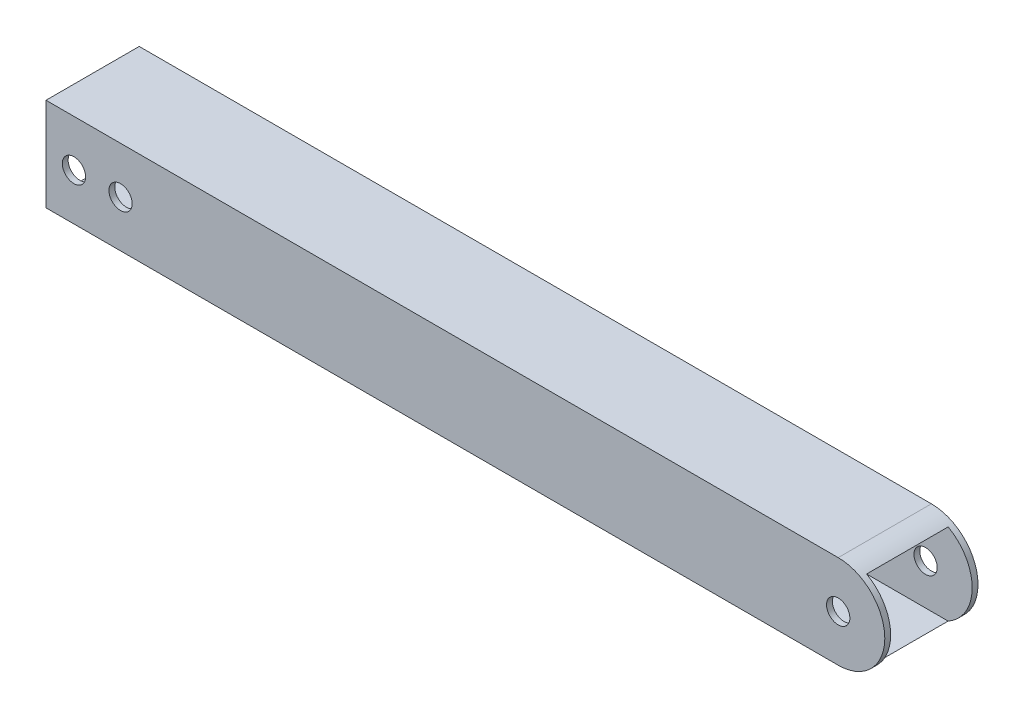
ISO-10303-21;
HEADER;
FILE_DESCRIPTION(('STEP AP214'),'2;1');
FILE_NAME('part.step','',(''),(''),'','','');
FILE_SCHEMA(('AUTOMOTIVE_DESIGN { 1 0 10303 214 1 1 1 1 }'));
ENDSEC;
DATA;
#1=APPLICATION_CONTEXT('core data for automotive mechanical design processes');
#2=APPLICATION_PROTOCOL_DEFINITION('international standard','automotive_design',2000,#1);
#3=PRODUCT_CONTEXT('',#1,'mechanical');
#4=PRODUCT('Part','Part','',(#3));
#5=PRODUCT_RELATED_PRODUCT_CATEGORY('part','',(#4));
#6=PRODUCT_DEFINITION_FORMATION('','',#4);
#7=PRODUCT_DEFINITION_CONTEXT('part definition',#1,'design');
#8=PRODUCT_DEFINITION('design','',#6,#7);
#9=PRODUCT_DEFINITION_SHAPE('','',#8);
#10=(LENGTH_UNIT() NAMED_UNIT(*) SI_UNIT(.MILLI.,.METRE.));
#11=(NAMED_UNIT(*) PLANE_ANGLE_UNIT() SI_UNIT($,.RADIAN.));
#12=(NAMED_UNIT(*) SI_UNIT($,.STERADIAN.) SOLID_ANGLE_UNIT());
#13=UNCERTAINTY_MEASURE_WITH_UNIT(LENGTH_MEASURE(1.E-05),#10,'distance_accuracy_value','');
#14=(GEOMETRIC_REPRESENTATION_CONTEXT(3) GLOBAL_UNCERTAINTY_ASSIGNED_CONTEXT((#13)) GLOBAL_UNIT_ASSIGNED_CONTEXT((#10,
#11,#12)) REPRESENTATION_CONTEXT('',''));
#15=CARTESIAN_POINT('',(0.,0.,0.));
#16=DIRECTION('',(0.,0.,1.));
#17=DIRECTION('',(1.,0.,0.));
#18=AXIS2_PLACEMENT_3D('',#15,#16,#17);
#19=CARTESIAN_POINT('',(228.6,12.7,-12.7));
#20=DIRECTION('',(0.,0.,1.));
#21=DIRECTION('',(0.,-1.,0.));
#22=AXIS2_PLACEMENT_3D('',#19,#20,#21);
#23=PLANE('',#22);
#24=CARTESIAN_POINT('',(215.9,0.,-12.7));
#25=DIRECTION('',(0.,0.,1.));
#26=DIRECTION('',(1.,0.,0.));
#27=AXIS2_PLACEMENT_3D('',#24,#25,#26);
#28=CIRCLE('',#27,3.175);
#29=CARTESIAN_POINT('',(219.075,0.,-12.7));
#30=VERTEX_POINT('',#29);
#31=EDGE_CURVE('E137',#30,#30,#28,.T.);
#32=ORIENTED_EDGE('',*,*,#31,.T.);
#33=EDGE_LOOP('',(#32));
#34=FACE_BOUND('',#33,.T.);
#35=CARTESIAN_POINT('',(7.62,0.,-12.7));
#36=DIRECTION('',(0.,0.,1.));
#37=DIRECTION('',(1.,0.,0.));
#38=AXIS2_PLACEMENT_3D('',#35,#36,#37);
#39=CIRCLE('',#38,3.175);
#40=CARTESIAN_POINT('',(10.795,0.,-12.7));
#41=VERTEX_POINT('',#40);
#42=EDGE_CURVE('E192',#41,#41,#39,.T.);
#43=ORIENTED_EDGE('',*,*,#42,.T.);
#44=EDGE_LOOP('',(#43));
#45=FACE_BOUND('',#44,.T.);
#46=CARTESIAN_POINT('',(20.32,0.,-12.7));
#47=DIRECTION('',(0.,0.,1.));
#48=DIRECTION('',(1.,0.,0.));
#49=AXIS2_PLACEMENT_3D('',#46,#47,#48);
#50=CIRCLE('',#49,3.175);
#51=CARTESIAN_POINT('',(23.495,0.,-12.7));
#52=VERTEX_POINT('',#51);
#53=EDGE_CURVE('E198',#52,#52,#50,.T.);
#54=ORIENTED_EDGE('',*,*,#53,.T.);
#55=EDGE_LOOP('',(#54));
#56=FACE_BOUND('',#55,.T.);
#57=CARTESIAN_POINT('',(215.9,0.,-12.7));
#58=DIRECTION('',(0.,0.,1.));
#59=DIRECTION('',(1.,0.,0.));
#60=AXIS2_PLACEMENT_3D('',#57,#58,#59);
#61=CIRCLE('',#60,12.7);
#62=CARTESIAN_POINT('',(215.9,12.7,-12.7));
#63=VERTEX_POINT('',#62);
#64=CARTESIAN_POINT('',(215.9,-12.7,-12.7));
#65=VERTEX_POINT('',#64);
#66=EDGE_CURVE('E100',#63,#65,#61,.F.);
#67=ORIENTED_EDGE('',*,*,#66,.T.);
#68=DIRECTION('',(-1.,0.,0.));
#69=VECTOR('',#68,1.);
#70=CARTESIAN_POINT('',(228.6,-12.7,-12.7));
#71=LINE('',#70,#69);
#72=CARTESIAN_POINT('',(0.,-12.7,-12.7));
#73=VERTEX_POINT('',#72);
#74=EDGE_CURVE('E104',#65,#73,#71,.T.);
#75=ORIENTED_EDGE('',*,*,#74,.T.);
#76=DIRECTION('',(0.,1.,0.));
#77=VECTOR('',#76,1.);
#78=CARTESIAN_POINT('',(0.,12.7,-12.7));
#79=LINE('',#78,#77);
#80=CARTESIAN_POINT('',(0.,12.7,-12.7));
#81=VERTEX_POINT('',#80);
#82=EDGE_CURVE('E167',#73,#81,#79,.T.);
#83=ORIENTED_EDGE('',*,*,#82,.T.);
#84=DIRECTION('',(-1.,0.,0.));
#85=VECTOR('',#84,1.);
#86=CARTESIAN_POINT('',(228.6,12.7,-12.7));
#87=LINE('',#86,#85);
#88=EDGE_CURVE('E106',#63,#81,#87,.T.);
#89=ORIENTED_EDGE('',*,*,#88,.F.);
#90=EDGE_LOOP('',(#67,#75,#83,#89));
#91=FACE_BOUND('',#90,.T.);
#92=ADVANCED_FACE('F37',(#34,#45,#56,#91),#23,.F.);
#93=CARTESIAN_POINT('',(228.6,12.7,12.7));
#94=DIRECTION('',(0.,0.,-1.));
#95=DIRECTION('',(0.,1.,0.));
#96=AXIS2_PLACEMENT_3D('',#93,#94,#95);
#97=PLANE('',#96);
#98=CARTESIAN_POINT('',(215.9,0.,12.7));
#99=DIRECTION('',(0.,0.,1.));
#100=DIRECTION('',(1.,0.,0.));
#101=AXIS2_PLACEMENT_3D('',#98,#99,#100);
#102=CIRCLE('',#101,3.175);
#103=CARTESIAN_POINT('',(219.075,0.,12.7));
#104=VERTEX_POINT('',#103);
#105=EDGE_CURVE('E189',#104,#104,#102,.T.);
#106=ORIENTED_EDGE('',*,*,#105,.F.);
#107=EDGE_LOOP('',(#106));
#108=FACE_BOUND('',#107,.T.);
#109=CARTESIAN_POINT('',(7.62,0.,12.7));
#110=DIRECTION('',(0.,0.,1.));
#111=DIRECTION('',(1.,0.,0.));
#112=AXIS2_PLACEMENT_3D('',#109,#110,#111);
#113=CIRCLE('',#112,3.175);
#114=CARTESIAN_POINT('',(10.795,0.,12.7));
#115=VERTEX_POINT('',#114);
#116=EDGE_CURVE('E195',#115,#115,#113,.T.);
#117=ORIENTED_EDGE('',*,*,#116,.F.);
#118=EDGE_LOOP('',(#117));
#119=FACE_BOUND('',#118,.T.);
#120=CARTESIAN_POINT('',(20.32,0.,12.7));
#121=DIRECTION('',(0.,0.,1.));
#122=DIRECTION('',(1.,0.,0.));
#123=AXIS2_PLACEMENT_3D('',#120,#121,#122);
#124=CIRCLE('',#123,3.175);
#125=CARTESIAN_POINT('',(23.495,0.,12.7));
#126=VERTEX_POINT('',#125);
#127=EDGE_CURVE('E186',#126,#126,#124,.T.);
#128=ORIENTED_EDGE('',*,*,#127,.F.);
#129=EDGE_LOOP('',(#128));
#130=FACE_BOUND('',#129,.T.);
#131=DIRECTION('',(-1.,0.,0.));
#132=VECTOR('',#131,1.);
#133=CARTESIAN_POINT('',(228.6,-12.7,12.7));
#134=LINE('',#133,#132);
#135=CARTESIAN_POINT('',(215.9,-12.7,12.7));
#136=VERTEX_POINT('',#135);
#137=CARTESIAN_POINT('',(0.,-12.7,12.7));
#138=VERTEX_POINT('',#137);
#139=EDGE_CURVE('E123',#136,#138,#134,.T.);
#140=ORIENTED_EDGE('',*,*,#139,.F.);
#141=CARTESIAN_POINT('',(215.9,0.,12.7));
#142=DIRECTION('',(0.,0.,1.));
#143=DIRECTION('',(1.,0.,0.));
#144=AXIS2_PLACEMENT_3D('',#141,#142,#143);
#145=CIRCLE('',#144,12.7);
#146=CARTESIAN_POINT('',(215.9,12.7,12.7));
#147=VERTEX_POINT('',#146);
#148=EDGE_CURVE('E110',#147,#136,#145,.F.);
#149=ORIENTED_EDGE('',*,*,#148,.F.);
#150=DIRECTION('',(-1.,0.,0.));
#151=VECTOR('',#150,1.);
#152=CARTESIAN_POINT('',(228.6,12.7,12.7));
#153=LINE('',#152,#151);
#154=CARTESIAN_POINT('',(0.,12.7,12.7));
#155=VERTEX_POINT('',#154);
#156=EDGE_CURVE('E125',#147,#155,#153,.T.);
#157=ORIENTED_EDGE('',*,*,#156,.T.);
#158=DIRECTION('',(0.,-1.,0.));
#159=VECTOR('',#158,1.);
#160=CARTESIAN_POINT('',(0.,12.7,12.7));
#161=LINE('',#160,#159);
#162=EDGE_CURVE('E127',#155,#138,#161,.T.);
#163=ORIENTED_EDGE('',*,*,#162,.T.);
#164=EDGE_LOOP('',(#140,#149,#157,#163));
#165=FACE_BOUND('',#164,.T.);
#166=ADVANCED_FACE('F174',(#108,#119,#130,#165),#97,.F.);
#167=CARTESIAN_POINT('',(228.6,11.1125,11.1125));
#168=DIRECTION('',(0.,0.,-1.));
#169=DIRECTION('',(0.,1.,0.));
#170=AXIS2_PLACEMENT_3D('',#167,#168,#169);
#171=PLANE('',#170);
#172=CARTESIAN_POINT('',(215.9,0.,11.1125));
#173=DIRECTION('',(0.,0.,-1.));
#174=DIRECTION('',(0.,1.,0.));
#175=AXIS2_PLACEMENT_3D('',#172,#173,#174);
#176=CIRCLE('',#175,3.175);
#177=CARTESIAN_POINT('',(215.9,3.175,11.1125));
#178=VERTEX_POINT('',#177);
#179=EDGE_CURVE('E144',#178,#178,#176,.T.);
#180=ORIENTED_EDGE('',*,*,#179,.F.);
#181=EDGE_LOOP('',(#180));
#182=FACE_BOUND('',#181,.T.);
#183=CARTESIAN_POINT('',(7.62,0.,11.1125));
#184=DIRECTION('',(0.,0.,-1.));
#185=DIRECTION('',(0.,1.,0.));
#186=AXIS2_PLACEMENT_3D('',#183,#184,#185);
#187=CIRCLE('',#186,3.175);
#188=CARTESIAN_POINT('',(7.62,3.175,11.1125));
#189=VERTEX_POINT('',#188);
#190=EDGE_CURVE('E141',#189,#189,#187,.T.);
#191=ORIENTED_EDGE('',*,*,#190,.F.);
#192=EDGE_LOOP('',(#191));
#193=FACE_BOUND('',#192,.T.);
#194=CARTESIAN_POINT('',(20.32,0.,11.1125));
#195=DIRECTION('',(0.,0.,-1.));
#196=DIRECTION('',(0.,1.,0.));
#197=AXIS2_PLACEMENT_3D('',#194,#195,#196);
#198=CIRCLE('',#197,3.175);
#199=CARTESIAN_POINT('',(20.32,3.175,11.1125));
#200=VERTEX_POINT('',#199);
#201=EDGE_CURVE('E136',#200,#200,#198,.T.);
#202=ORIENTED_EDGE('',*,*,#201,.F.);
#203=EDGE_LOOP('',(#202));
#204=FACE_BOUND('',#203,.T.);
#205=CARTESIAN_POINT('',(215.9,0.,11.1125));
#206=DIRECTION('',(0.,0.,-1.));
#207=DIRECTION('',(0.,1.,0.));
#208=AXIS2_PLACEMENT_3D('',#205,#206,#207);
#209=CIRCLE('',#208,12.7);
#210=CARTESIAN_POINT('',(222.048361062104,-11.1125,11.1125));
#211=VERTEX_POINT('',#210);
#212=CARTESIAN_POINT('',(222.048361062104,11.1125,11.1125));
#213=VERTEX_POINT('',#212);
#214=EDGE_CURVE('E50',#211,#213,#209,.F.);
#215=ORIENTED_EDGE('',*,*,#214,.F.);
#216=DIRECTION('',(-1.,0.,0.));
#217=VECTOR('',#216,1.);
#218=CARTESIAN_POINT('',(228.6,-11.1125,11.1125));
#219=LINE('',#218,#217);
#220=CARTESIAN_POINT('',(0.,-11.1125,11.1125));
#221=VERTEX_POINT('',#220);
#222=EDGE_CURVE('E161',#211,#221,#219,.T.);
#223=ORIENTED_EDGE('',*,*,#222,.T.);
#224=DIRECTION('',(0.,-1.,0.));
#225=VECTOR('',#224,1.);
#226=CARTESIAN_POINT('',(0.,11.1125,11.1125));
#227=LINE('',#226,#225);
#228=CARTESIAN_POINT('',(0.,11.1125,11.1125));
#229=VERTEX_POINT('',#228);
#230=EDGE_CURVE('E209',#229,#221,#227,.T.);
#231=ORIENTED_EDGE('',*,*,#230,.F.);
#232=DIRECTION('',(-1.,0.,0.));
#233=VECTOR('',#232,1.);
#234=CARTESIAN_POINT('',(228.6,11.1125,11.1125));
#235=LINE('',#234,#233);
#236=EDGE_CURVE('E57',#213,#229,#235,.T.);
#237=ORIENTED_EDGE('',*,*,#236,.F.);
#238=EDGE_LOOP('',(#215,#223,#231,#237));
#239=FACE_BOUND('',#238,.T.);
#240=ADVANCED_FACE('F221',(#182,#193,#204,#239),#171,.T.);
#241=CARTESIAN_POINT('',(228.6,11.1125,-11.1125));
#242=DIRECTION('',(0.,0.,1.));
#243=DIRECTION('',(0.,-1.,0.));
#244=AXIS2_PLACEMENT_3D('',#241,#242,#243);
#245=PLANE('',#244);
#246=CARTESIAN_POINT('',(215.9,0.,-11.1125));
#247=DIRECTION('',(0.,0.,1.));
#248=DIRECTION('',(0.,-1.,0.));
#249=AXIS2_PLACEMENT_3D('',#246,#247,#248);
#250=CIRCLE('',#249,3.175);
#251=CARTESIAN_POINT('',(215.9,-3.175,-11.1125));
#252=VERTEX_POINT('',#251);
#253=EDGE_CURVE('E142',#252,#252,#250,.T.);
#254=ORIENTED_EDGE('',*,*,#253,.F.);
#255=EDGE_LOOP('',(#254));
#256=FACE_BOUND('',#255,.T.);
#257=CARTESIAN_POINT('',(7.62,0.,-11.1125));
#258=DIRECTION('',(0.,0.,1.));
#259=DIRECTION('',(0.,-1.,0.));
#260=AXIS2_PLACEMENT_3D('',#257,#258,#259);
#261=CIRCLE('',#260,3.175);
#262=CARTESIAN_POINT('',(7.62,-3.175,-11.1125));
#263=VERTEX_POINT('',#262);
#264=EDGE_CURVE('E138',#263,#263,#261,.T.);
#265=ORIENTED_EDGE('',*,*,#264,.F.);
#266=EDGE_LOOP('',(#265));
#267=FACE_BOUND('',#266,.T.);
#268=CARTESIAN_POINT('',(20.32,0.,-11.1125));
#269=DIRECTION('',(0.,0.,1.));
#270=DIRECTION('',(0.,-1.,0.));
#271=AXIS2_PLACEMENT_3D('',#268,#269,#270);
#272=CIRCLE('',#271,3.175);
#273=CARTESIAN_POINT('',(20.32,-3.175,-11.1125));
#274=VERTEX_POINT('',#273);
#275=EDGE_CURVE('E133',#274,#274,#272,.T.);
#276=ORIENTED_EDGE('',*,*,#275,.F.);
#277=EDGE_LOOP('',(#276));
#278=FACE_BOUND('',#277,.T.);
#279=DIRECTION('',(-1.,0.,0.));
#280=VECTOR('',#279,1.);
#281=CARTESIAN_POINT('',(228.6,-11.1125,-11.1125));
#282=LINE('',#281,#280);
#283=CARTESIAN_POINT('',(222.048361062104,-11.1125,-11.1125));
#284=VERTEX_POINT('',#283);
#285=CARTESIAN_POINT('',(0.,-11.1125,-11.1125));
#286=VERTEX_POINT('',#285);
#287=EDGE_CURVE('E154',#284,#286,#282,.T.);
#288=ORIENTED_EDGE('',*,*,#287,.F.);
#289=CARTESIAN_POINT('',(215.9,0.,-11.1125));
#290=DIRECTION('',(0.,0.,1.));
#291=DIRECTION('',(0.,-1.,0.));
#292=AXIS2_PLACEMENT_3D('',#289,#290,#291);
#293=CIRCLE('',#292,12.7);
#294=CARTESIAN_POINT('',(222.048361062104,11.1125,-11.1125));
#295=VERTEX_POINT('',#294);
#296=EDGE_CURVE('E146',#295,#284,#293,.F.);
#297=ORIENTED_EDGE('',*,*,#296,.F.);
#298=DIRECTION('',(-1.,0.,0.));
#299=VECTOR('',#298,1.);
#300=CARTESIAN_POINT('',(228.6,11.1125,-11.1125));
#301=LINE('',#300,#299);
#302=CARTESIAN_POINT('',(0.,11.1125,-11.1125));
#303=VERTEX_POINT('',#302);
#304=EDGE_CURVE('E153',#295,#303,#301,.T.);
#305=ORIENTED_EDGE('',*,*,#304,.T.);
#306=DIRECTION('',(0.,1.,0.));
#307=VECTOR('',#306,1.);
#308=CARTESIAN_POINT('',(0.,11.1125,-11.1125));
#309=LINE('',#308,#307);
#310=EDGE_CURVE('E215',#286,#303,#309,.T.);
#311=ORIENTED_EDGE('',*,*,#310,.F.);
#312=EDGE_LOOP('',(#288,#297,#305,#311));
#313=FACE_BOUND('',#312,.T.);
#314=ADVANCED_FACE('F151',(#256,#267,#278,#313),#245,.T.);
#315=CARTESIAN_POINT('',(228.6,-12.7,12.7));
#316=DIRECTION('',(0.,1.,0.));
#317=DIRECTION('',(0.,0.,1.));
#318=AXIS2_PLACEMENT_3D('',#315,#316,#317);
#319=PLANE('',#318);
#320=DIRECTION('',(0.,0.,1.));
#321=VECTOR('',#320,1.);
#322=CARTESIAN_POINT('',(215.9,-12.7,-12.7));
#323=LINE('',#322,#321);
#324=EDGE_CURVE('E113',#65,#136,#323,.T.);
#325=ORIENTED_EDGE('',*,*,#324,.T.);
#326=ORIENTED_EDGE('',*,*,#139,.T.);
#327=DIRECTION('',(0.,0.,-1.));
#328=VECTOR('',#327,1.);
#329=CARTESIAN_POINT('',(0.,-12.7,12.7));
#330=LINE('',#329,#328);
#331=EDGE_CURVE('E121',#138,#73,#330,.T.);
#332=ORIENTED_EDGE('',*,*,#331,.T.);
#333=ORIENTED_EDGE('',*,*,#74,.F.);
#334=EDGE_LOOP('',(#325,#326,#332,#333));
#335=FACE_BOUND('',#334,.T.);
#336=ADVANCED_FACE('F119',(#335),#319,.F.);
#337=CARTESIAN_POINT('',(0.,0.,0.));
#338=DIRECTION('',(1.,0.,0.));
#339=DIRECTION('',(0.,0.,-1.));
#340=AXIS2_PLACEMENT_3D('',#337,#338,#339);
#341=PLANE('',#340);
#342=ORIENTED_EDGE('',*,*,#82,.F.);
#343=ORIENTED_EDGE('',*,*,#331,.F.);
#344=ORIENTED_EDGE('',*,*,#162,.F.);
#345=DIRECTION('',(0.,0.,1.));
#346=VECTOR('',#345,1.);
#347=CARTESIAN_POINT('',(0.,12.7,12.7));
#348=LINE('',#347,#346);
#349=EDGE_CURVE('E169',#81,#155,#348,.T.);
#350=ORIENTED_EDGE('',*,*,#349,.F.);
#351=EDGE_LOOP('',(#342,#343,#344,#350));
#352=FACE_BOUND('',#351,.T.);
#353=ORIENTED_EDGE('',*,*,#230,.T.);
#354=DIRECTION('',(0.,0.,-1.));
#355=VECTOR('',#354,1.);
#356=CARTESIAN_POINT('',(0.,-11.1125,11.1125));
#357=LINE('',#356,#355);
#358=EDGE_CURVE('E212',#221,#286,#357,.T.);
#359=ORIENTED_EDGE('',*,*,#358,.T.);
#360=ORIENTED_EDGE('',*,*,#310,.T.);
#361=DIRECTION('',(0.,0.,1.));
#362=VECTOR('',#361,1.);
#363=CARTESIAN_POINT('',(0.,11.1125,11.1125));
#364=LINE('',#363,#362);
#365=EDGE_CURVE('E158',#303,#229,#364,.T.);
#366=ORIENTED_EDGE('',*,*,#365,.T.);
#367=EDGE_LOOP('',(#353,#359,#360,#366));
#368=FACE_BOUND('',#367,.T.);
#369=ADVANCED_FACE('F178',(#352,#368),#341,.F.);
#370=CARTESIAN_POINT('',(228.6,12.7,12.7));
#371=DIRECTION('',(0.,-1.,0.));
#372=DIRECTION('',(0.,0.,-1.));
#373=AXIS2_PLACEMENT_3D('',#370,#371,#372);
#374=PLANE('',#373);
#375=ORIENTED_EDGE('',*,*,#156,.F.);
#376=DIRECTION('',(0.,0.,1.));
#377=VECTOR('',#376,1.);
#378=CARTESIAN_POINT('',(215.9,12.7,-12.7));
#379=LINE('',#378,#377);
#380=EDGE_CURVE('E109',#63,#147,#379,.T.);
#381=ORIENTED_EDGE('',*,*,#380,.F.);
#382=ORIENTED_EDGE('',*,*,#88,.T.);
#383=ORIENTED_EDGE('',*,*,#349,.T.);
#384=EDGE_LOOP('',(#375,#381,#382,#383));
#385=FACE_BOUND('',#384,.T.);
#386=ADVANCED_FACE('F181',(#385),#374,.F.);
#387=CARTESIAN_POINT('',(228.6,-11.1125,11.1125));
#388=DIRECTION('',(0.,1.,0.));
#389=DIRECTION('',(0.,0.,1.));
#390=AXIS2_PLACEMENT_3D('',#387,#388,#389);
#391=PLANE('',#390);
#392=DIRECTION('',(0.,0.,1.));
#393=VECTOR('',#392,1.);
#394=CARTESIAN_POINT('',(222.048361062104,-11.1125,-12.7));
#395=LINE('',#394,#393);
#396=EDGE_CURVE('E11',#284,#211,#395,.T.);
#397=ORIENTED_EDGE('',*,*,#396,.F.);
#398=ORIENTED_EDGE('',*,*,#287,.T.);
#399=ORIENTED_EDGE('',*,*,#358,.F.);
#400=ORIENTED_EDGE('',*,*,#222,.F.);
#401=EDGE_LOOP('',(#397,#398,#399,#400));
#402=FACE_BOUND('',#401,.T.);
#403=ADVANCED_FACE('F219',(#402),#391,.T.);
#404=CARTESIAN_POINT('',(228.6,11.1125,11.1125));
#405=DIRECTION('',(0.,-1.,0.));
#406=DIRECTION('',(0.,0.,-1.));
#407=AXIS2_PLACEMENT_3D('',#404,#405,#406);
#408=PLANE('',#407);
#409=DIRECTION('',(0.,0.,1.));
#410=VECTOR('',#409,1.);
#411=CARTESIAN_POINT('',(222.048361062104,11.1125,-12.7));
#412=LINE('',#411,#410);
#413=EDGE_CURVE('E44',#213,#295,#412,.F.);
#414=ORIENTED_EDGE('',*,*,#413,.F.);
#415=ORIENTED_EDGE('',*,*,#236,.T.);
#416=ORIENTED_EDGE('',*,*,#365,.F.);
#417=ORIENTED_EDGE('',*,*,#304,.F.);
#418=EDGE_LOOP('',(#414,#415,#416,#417));
#419=FACE_BOUND('',#418,.T.);
#420=ADVANCED_FACE('F156',(#419),#408,.T.);
#421=CARTESIAN_POINT('',(20.32,0.,-12.7));
#422=DIRECTION('',(0.,0.,1.));
#423=DIRECTION('',(1.,0.,0.));
#424=AXIS2_PLACEMENT_3D('',#421,#422,#423);
#425=CYLINDRICAL_SURFACE('',#424,3.175);
#426=ORIENTED_EDGE('',*,*,#275,.T.);
#427=EDGE_LOOP('',(#426));
#428=FACE_BOUND('',#427,.T.);
#429=ORIENTED_EDGE('',*,*,#53,.F.);
#430=EDGE_LOOP('',(#429));
#431=FACE_BOUND('',#430,.T.);
#432=ADVANCED_FACE('F247',(#428,#431),#425,.F.);
#433=CARTESIAN_POINT('',(7.62,0.,-12.7));
#434=DIRECTION('',(0.,0.,1.));
#435=DIRECTION('',(1.,0.,0.));
#436=AXIS2_PLACEMENT_3D('',#433,#434,#435);
#437=CYLINDRICAL_SURFACE('',#436,3.175);
#438=ORIENTED_EDGE('',*,*,#264,.T.);
#439=EDGE_LOOP('',(#438));
#440=FACE_BOUND('',#439,.T.);
#441=ORIENTED_EDGE('',*,*,#42,.F.);
#442=EDGE_LOOP('',(#441));
#443=FACE_BOUND('',#442,.T.);
#444=ADVANCED_FACE('F249',(#440,#443),#437,.F.);
#445=CARTESIAN_POINT('',(215.9,0.,-12.7));
#446=DIRECTION('',(0.,0.,1.));
#447=DIRECTION('',(1.,0.,0.));
#448=AXIS2_PLACEMENT_3D('',#445,#446,#447);
#449=CYLINDRICAL_SURFACE('',#448,3.175);
#450=ORIENTED_EDGE('',*,*,#253,.T.);
#451=EDGE_LOOP('',(#450));
#452=FACE_BOUND('',#451,.T.);
#453=ORIENTED_EDGE('',*,*,#31,.F.);
#454=EDGE_LOOP('',(#453));
#455=FACE_BOUND('',#454,.T.);
#456=ADVANCED_FACE('F257',(#452,#455),#449,.F.);
#457=ORIENTED_EDGE('',*,*,#201,.T.);
#458=EDGE_LOOP('',(#457));
#459=FACE_BOUND('',#458,.T.);
#460=ORIENTED_EDGE('',*,*,#127,.T.);
#461=EDGE_LOOP('',(#460));
#462=FACE_BOUND('',#461,.T.);
#463=ADVANCED_FACE('F252',(#459,#462),#425,.F.);
#464=ORIENTED_EDGE('',*,*,#190,.T.);
#465=EDGE_LOOP('',(#464));
#466=FACE_BOUND('',#465,.T.);
#467=ORIENTED_EDGE('',*,*,#116,.T.);
#468=EDGE_LOOP('',(#467));
#469=FACE_BOUND('',#468,.T.);
#470=ADVANCED_FACE('F260',(#466,#469),#437,.F.);
#471=ORIENTED_EDGE('',*,*,#179,.T.);
#472=EDGE_LOOP('',(#471));
#473=FACE_BOUND('',#472,.T.);
#474=ORIENTED_EDGE('',*,*,#105,.T.);
#475=EDGE_LOOP('',(#474));
#476=FACE_BOUND('',#475,.T.);
#477=ADVANCED_FACE('F268',(#473,#476),#449,.F.);
#478=CARTESIAN_POINT('',(215.9,0.,-12.7));
#479=DIRECTION('',(0.,0.,1.));
#480=DIRECTION('',(1.,0.,0.));
#481=AXIS2_PLACEMENT_3D('',#478,#479,#480);
#482=CYLINDRICAL_SURFACE('',#481,12.7);
#483=ORIENTED_EDGE('',*,*,#296,.T.);
#484=ORIENTED_EDGE('',*,*,#396,.T.);
#485=ORIENTED_EDGE('',*,*,#214,.T.);
#486=ORIENTED_EDGE('',*,*,#413,.T.);
#487=EDGE_LOOP('',(#483,#484,#485,#486));
#488=FACE_BOUND('',#487,.T.);
#489=ORIENTED_EDGE('',*,*,#324,.F.);
#490=ORIENTED_EDGE('',*,*,#66,.F.);
#491=ORIENTED_EDGE('',*,*,#380,.T.);
#492=ORIENTED_EDGE('',*,*,#148,.T.);
#493=EDGE_LOOP('',(#489,#490,#491,#492));
#494=FACE_BOUND('',#493,.T.);
#495=ADVANCED_FACE('F114',(#488,#494),#482,.T.);
#496=CLOSED_SHELL('',(#92,#166,#240,#314,#336,#369,#386,#403,#420,#432,#444,#456,#463,#470,#477,#495));
#497=MANIFOLD_SOLID_BREP('B2',#496);
#498=ADVANCED_BREP_SHAPE_REPRESENTATION('',(#18,#497),#14);
#499=SHAPE_DEFINITION_REPRESENTATION(#9,#498);
ENDSEC;
END-ISO-10303-21;
